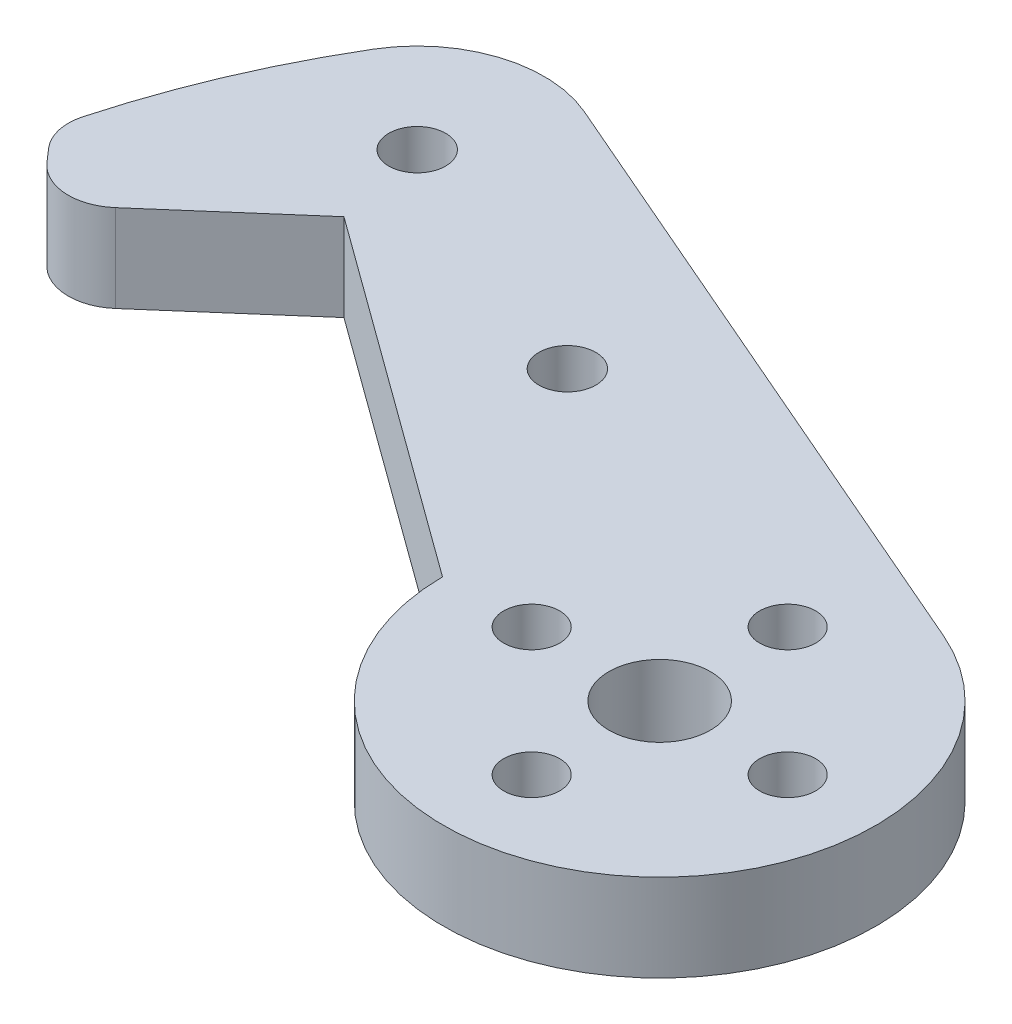
ISO-10303-21;
HEADER;
FILE_DESCRIPTION(('STEP AP214'),'2;1');
FILE_NAME('part.step','',(''),(''),'','','');
FILE_SCHEMA(('AUTOMOTIVE_DESIGN { 1 0 10303 214 1 1 1 1 }'));
ENDSEC;
DATA;
#1=APPLICATION_CONTEXT('core data for automotive mechanical design processes');
#2=APPLICATION_PROTOCOL_DEFINITION('international standard','automotive_design',2000,#1);
#3=PRODUCT_CONTEXT('',#1,'mechanical');
#4=PRODUCT('Part','Part','',(#3));
#5=PRODUCT_RELATED_PRODUCT_CATEGORY('part','',(#4));
#6=PRODUCT_DEFINITION_FORMATION('','',#4);
#7=PRODUCT_DEFINITION_CONTEXT('part definition',#1,'design');
#8=PRODUCT_DEFINITION('design','',#6,#7);
#9=PRODUCT_DEFINITION_SHAPE('','',#8);
#10=(LENGTH_UNIT() NAMED_UNIT(*) SI_UNIT(.MILLI.,.METRE.));
#11=(NAMED_UNIT(*) PLANE_ANGLE_UNIT() SI_UNIT($,.RADIAN.));
#12=(NAMED_UNIT(*) SI_UNIT($,.STERADIAN.) SOLID_ANGLE_UNIT());
#13=UNCERTAINTY_MEASURE_WITH_UNIT(LENGTH_MEASURE(1.E-05),#10,'distance_accuracy_value','');
#14=(GEOMETRIC_REPRESENTATION_CONTEXT(3) GLOBAL_UNCERTAINTY_ASSIGNED_CONTEXT((#13)) GLOBAL_UNIT_ASSIGNED_CONTEXT((#10,
#11,#12)) REPRESENTATION_CONTEXT('',''));
#15=CARTESIAN_POINT('',(0.,0.,0.));
#16=DIRECTION('',(0.,0.,1.));
#17=DIRECTION('',(1.,0.,0.));
#18=AXIS2_PLACEMENT_3D('',#15,#16,#17);
#19=CARTESIAN_POINT('',(-45.8483581971997,5.461,-12.1373981635231));
#20=DIRECTION('',(0.,-1.,0.));
#21=DIRECTION('',(0.,0.,-1.));
#22=AXIS2_PLACEMENT_3D('',#19,#20,#21);
#23=PLANE('',#22);
#24=CARTESIAN_POINT('',(-45.8483581971997,5.461,-12.1373981635231));
#25=DIRECTION('',(0.,1.,0.));
#26=DIRECTION('',(0.,0.,-1.));
#27=AXIS2_PLACEMENT_3D('',#24,#25,#26);
#28=CIRCLE('',#27,3.25);
#29=CARTESIAN_POINT('',(-48.2986608733251,5.461,-10.0023298284639));
#30=VERTEX_POINT('',#29);
#31=CARTESIAN_POINT('',(-43.7132898621404,5.461,-9.68709548739777));
#32=VERTEX_POINT('',#31);
#33=EDGE_CURVE('E157',#30,#32,#28,.T.);
#34=ORIENTED_EDGE('',*,*,#33,.T.);
#35=DIRECTION('',(0.753939284961654,0.,-0.656944103095164));
#36=VECTOR('',#35,1.);
#37=CARTESIAN_POINT('',(-36.0755531118412,5.461,-16.3422283597451));
#38=LINE('',#37,#36);
#39=CARTESIAN_POINT('',(-36.0755531118412,5.461,-16.3422283597451));
#40=VERTEX_POINT('',#39);
#41=EDGE_CURVE('E100',#32,#40,#38,.T.);
#42=ORIENTED_EDGE('',*,*,#41,.T.);
#43=DIRECTION('',(0.808767465357848,0.,0.588128546304839));
#44=VECTOR('',#43,1.);
#45=CARTESIAN_POINT('',(-36.0755531118412,5.461,-16.3422283597451));
#46=LINE('',#45,#44);
#47=CARTESIAN_POINT('',(-13.4997935259034,5.461,0.0746643018933128));
#48=VERTEX_POINT('',#47);
#49=EDGE_CURVE('E175',#40,#48,#46,.T.);
#50=ORIENTED_EDGE('',*,*,#49,.T.);
#51=CARTESIAN_POINT('',(0.,5.461,0.));
#52=DIRECTION('',(0.,1.,0.));
#53=DIRECTION('',(0.,0.,1.));
#54=AXIS2_PLACEMENT_3D('',#51,#52,#53);
#55=CIRCLE('',#54,13.5);
#56=CARTESIAN_POINT('',(5.36363887672502,5.461,-12.3887601478148));
#57=VERTEX_POINT('',#56);
#58=EDGE_CURVE('E192',#48,#57,#55,.T.);
#59=ORIENTED_EDGE('',*,*,#58,.T.);
#60=DIRECTION('',(-0.91768593687517,0.,-0.397306583461113));
#61=VECTOR('',#60,1.);
#62=CARTESIAN_POINT('',(-34.2596328863461,5.461,-29.5434163293646));
#63=LINE('',#62,#61);
#64=CARTESIAN_POINT('',(-34.2596328863461,5.461,-29.5434163293646));
#65=VERTEX_POINT('',#64);
#66=EDGE_CURVE('E191',#57,#65,#63,.T.);
#67=ORIENTED_EDGE('',*,*,#66,.T.);
#68=CARTESIAN_POINT('',(-37.4132538925687,5.461,-22.2592842054179));
#69=DIRECTION('',(0.,1.,0.));
#70=DIRECTION('',(0.,0.,1.));
#71=AXIS2_PLACEMENT_3D('',#68,#69,#70);
#72=CIRCLE('',#71,7.93750000000001);
#73=CARTESIAN_POINT('',(-44.234733224639,5.461,-26.3177723441387));
#74=VERTEX_POINT('',#73);
#75=EDGE_CURVE('E122',#65,#74,#72,.T.);
#76=ORIENTED_EDGE('',*,*,#75,.T.);
#77=CARTESIAN_POINT('',(0.,5.461,0.));
#78=DIRECTION('',(0.,1.,0.));
#79=DIRECTION('',(0.,0.,-1.));
#80=AXIS2_PLACEMENT_3D('',#77,#78,#79);
#81=CIRCLE('',#80,51.4717083902691);
#82=CARTESIAN_POINT('',(-49.6461942024214,5.461,-13.5864699546406));
#83=VERTEX_POINT('',#82);
#84=EDGE_CURVE('E116',#74,#83,#81,.T.);
#85=ORIENTED_EDGE('',*,*,#84,.T.);
#86=CARTESIAN_POINT('',(-46.7525932852344,5.461,-12.7945900824033));
#87=DIRECTION('',(0.,1.,0.));
#88=DIRECTION('',(0.,0.,1.));
#89=AXIS2_PLACEMENT_3D('',#86,#87,#88);
#90=CIRCLE('',#89,3.);
#91=CARTESIAN_POINT('',(-49.0144111401194,5.461,-10.8237577731178));
#92=VERTEX_POINT('',#91);
#93=EDGE_CURVE('E120',#83,#92,#90,.T.);
#94=ORIENTED_EDGE('',*,*,#93,.T.);
#95=DIRECTION('',(0.656944103095165,0.,0.753939284961653));
#96=VECTOR('',#95,1.);
#97=CARTESIAN_POINT('',(-48.2986608733251,5.461,-10.0023298284639));
#98=LINE('',#97,#96);
#99=EDGE_CURVE('E54',#92,#30,#98,.T.);
#100=ORIENTED_EDGE('',*,*,#99,.T.);
#101=EDGE_LOOP('',(#34,#42,#50,#59,#67,#76,#85,#94,#100));
#102=FACE_BOUND('',#101,.T.);
#103=CARTESIAN_POINT('',(-20.8624589223986,5.461,-15.0937174914343));
#104=DIRECTION('',(0.,1.,0.));
#105=DIRECTION('',(0.,0.,1.));
#106=AXIS2_PLACEMENT_3D('',#103,#104,#105);
#107=CIRCLE('',#106,1.778);
#108=CARTESIAN_POINT('',(-20.8624589223986,5.461,-13.3157174914343));
#109=VERTEX_POINT('',#108);
#110=EDGE_CURVE('E144',#109,#109,#107,.T.);
#111=ORIENTED_EDGE('',*,*,#110,.F.);
#112=EDGE_LOOP('',(#111));
#113=FACE_BOUND('',#112,.T.);
#114=CARTESIAN_POINT('',(8.00000000000001,5.461,0.));
#115=DIRECTION('',(0.,1.,0.));
#116=DIRECTION('',(0.,0.,1.));
#117=AXIS2_PLACEMENT_3D('',#114,#115,#116);
#118=CIRCLE('',#117,1.74999999999999);
#119=CARTESIAN_POINT('',(8.00000000000001,5.461,1.74999999999999));
#120=VERTEX_POINT('',#119);
#121=EDGE_CURVE('E202',#120,#120,#118,.T.);
#122=ORIENTED_EDGE('',*,*,#121,.F.);
#123=EDGE_LOOP('',(#122));
#124=FACE_BOUND('',#123,.T.);
#125=CARTESIAN_POINT('',(0.,5.461,7.99999999999999));
#126=DIRECTION('',(0.,1.,0.));
#127=DIRECTION('',(0.,0.,1.));
#128=AXIS2_PLACEMENT_3D('',#125,#126,#127);
#129=CIRCLE('',#128,1.75);
#130=CARTESIAN_POINT('',(0.,5.461,9.74999999999999));
#131=VERTEX_POINT('',#130);
#132=EDGE_CURVE('E208',#131,#131,#129,.T.);
#133=ORIENTED_EDGE('',*,*,#132,.F.);
#134=EDGE_LOOP('',(#133));
#135=FACE_BOUND('',#134,.T.);
#136=CARTESIAN_POINT('',(-8.00000000000001,5.461,0.));
#137=DIRECTION('',(0.,1.,0.));
#138=DIRECTION('',(0.,0.,1.));
#139=AXIS2_PLACEMENT_3D('',#136,#137,#138);
#140=CIRCLE('',#139,1.75000000000001);
#141=CARTESIAN_POINT('',(-8.00000000000001,5.461,1.75000000000001));
#142=VERTEX_POINT('',#141);
#143=EDGE_CURVE('E214',#142,#142,#140,.T.);
#144=ORIENTED_EDGE('',*,*,#143,.F.);
#145=EDGE_LOOP('',(#144));
#146=FACE_BOUND('',#145,.T.);
#147=CARTESIAN_POINT('',(0.,5.461,-7.99999999999999));
#148=DIRECTION('',(0.,1.,0.));
#149=DIRECTION('',(0.,0.,1.));
#150=AXIS2_PLACEMENT_3D('',#147,#148,#149);
#151=CIRCLE('',#150,1.75);
#152=CARTESIAN_POINT('',(0.,5.461,-6.24999999999999));
#153=VERTEX_POINT('',#152);
#154=EDGE_CURVE('E220',#153,#153,#151,.T.);
#155=ORIENTED_EDGE('',*,*,#154,.F.);
#156=EDGE_LOOP('',(#155));
#157=FACE_BOUND('',#156,.T.);
#158=CARTESIAN_POINT('',(0.,5.461,0.));
#159=DIRECTION('',(0.,1.,0.));
#160=DIRECTION('',(0.,0.,1.));
#161=AXIS2_PLACEMENT_3D('',#158,#159,#160);
#162=CIRCLE('',#161,3.175);
#163=CARTESIAN_POINT('',(0.,5.461,3.175));
#164=VERTEX_POINT('',#163);
#165=EDGE_CURVE('E226',#164,#164,#162,.T.);
#166=ORIENTED_EDGE('',*,*,#165,.F.);
#167=EDGE_LOOP('',(#166));
#168=FACE_BOUND('',#167,.T.);
#169=CARTESIAN_POINT('',(-37.4132538925687,5.461,-22.2592842054179));
#170=DIRECTION('',(0.,1.,0.));
#171=DIRECTION('',(0.,0.,1.));
#172=AXIS2_PLACEMENT_3D('',#169,#170,#171);
#173=CIRCLE('',#172,1.778);
#174=CARTESIAN_POINT('',(-37.4132538925687,5.461,-20.4812842054179));
#175=VERTEX_POINT('',#174);
#176=EDGE_CURVE('E232',#175,#175,#173,.T.);
#177=ORIENTED_EDGE('',*,*,#176,.F.);
#178=EDGE_LOOP('',(#177));
#179=FACE_BOUND('',#178,.T.);
#180=ADVANCED_FACE('F37',(#102,#113,#124,#135,#146,#157,#168,#179),#23,.F.);
#181=CARTESIAN_POINT('',(-45.8483581971997,0.,-12.1373981635231));
#182=DIRECTION('',(0.,-1.,0.));
#183=DIRECTION('',(0.,0.,-1.));
#184=AXIS2_PLACEMENT_3D('',#181,#182,#183);
#185=PLANE('',#184);
#186=CARTESIAN_POINT('',(0.,0.,0.));
#187=DIRECTION('',(0.,1.,0.));
#188=DIRECTION('',(0.,0.,1.));
#189=AXIS2_PLACEMENT_3D('',#186,#187,#188);
#190=CIRCLE('',#189,3.175);
#191=CARTESIAN_POINT('',(0.,0.,3.175));
#192=VERTEX_POINT('',#191);
#193=EDGE_CURVE('E229',#192,#192,#190,.T.);
#194=ORIENTED_EDGE('',*,*,#193,.T.);
#195=EDGE_LOOP('',(#194));
#196=FACE_BOUND('',#195,.T.);
#197=CARTESIAN_POINT('',(-8.00000000000001,0.,0.));
#198=DIRECTION('',(0.,1.,0.));
#199=DIRECTION('',(0.,0.,1.));
#200=AXIS2_PLACEMENT_3D('',#197,#198,#199);
#201=CIRCLE('',#200,1.75000000000001);
#202=CARTESIAN_POINT('',(-8.00000000000001,0.,1.75000000000001));
#203=VERTEX_POINT('',#202);
#204=EDGE_CURVE('E217',#203,#203,#201,.T.);
#205=ORIENTED_EDGE('',*,*,#204,.T.);
#206=EDGE_LOOP('',(#205));
#207=FACE_BOUND('',#206,.T.);
#208=CARTESIAN_POINT('',(8.00000000000001,0.,0.));
#209=DIRECTION('',(0.,1.,0.));
#210=DIRECTION('',(0.,0.,1.));
#211=AXIS2_PLACEMENT_3D('',#208,#209,#210);
#212=CIRCLE('',#211,1.74999999999999);
#213=CARTESIAN_POINT('',(8.00000000000001,0.,1.74999999999999));
#214=VERTEX_POINT('',#213);
#215=EDGE_CURVE('E205',#214,#214,#212,.T.);
#216=ORIENTED_EDGE('',*,*,#215,.T.);
#217=EDGE_LOOP('',(#216));
#218=FACE_BOUND('',#217,.T.);
#219=CARTESIAN_POINT('',(-45.8483581971997,0.,-12.1373981635231));
#220=DIRECTION('',(0.,1.,0.));
#221=DIRECTION('',(0.,0.,-1.));
#222=AXIS2_PLACEMENT_3D('',#219,#220,#221);
#223=CIRCLE('',#222,3.25);
#224=CARTESIAN_POINT('',(-48.2986608733251,0.,-10.0023298284639));
#225=VERTEX_POINT('',#224);
#226=CARTESIAN_POINT('',(-43.7132898621404,0.,-9.68709548739777));
#227=VERTEX_POINT('',#226);
#228=EDGE_CURVE('E140',#225,#227,#223,.T.);
#229=ORIENTED_EDGE('',*,*,#228,.F.);
#230=DIRECTION('',(0.656944103095165,0.,0.753939284961653));
#231=VECTOR('',#230,1.);
#232=CARTESIAN_POINT('',(-48.2986608733251,0.,-10.0023298284639));
#233=LINE('',#232,#231);
#234=CARTESIAN_POINT('',(-49.0144111401194,0.,-10.8237577731178));
#235=VERTEX_POINT('',#234);
#236=EDGE_CURVE('E92',#235,#225,#233,.T.);
#237=ORIENTED_EDGE('',*,*,#236,.F.);
#238=CARTESIAN_POINT('',(-46.7525932852344,0.,-12.7945900824033));
#239=DIRECTION('',(0.,1.,0.));
#240=DIRECTION('',(0.,0.,1.));
#241=AXIS2_PLACEMENT_3D('',#238,#239,#240);
#242=CIRCLE('',#241,3.);
#243=CARTESIAN_POINT('',(-49.6461942024214,0.,-13.5864699546406));
#244=VERTEX_POINT('',#243);
#245=EDGE_CURVE('E86',#244,#235,#242,.T.);
#246=ORIENTED_EDGE('',*,*,#245,.F.);
#247=CARTESIAN_POINT('',(0.,0.,0.));
#248=DIRECTION('',(0.,1.,0.));
#249=DIRECTION('',(0.,0.,-1.));
#250=AXIS2_PLACEMENT_3D('',#247,#248,#249);
#251=CIRCLE('',#250,51.4717083902691);
#252=CARTESIAN_POINT('',(-44.234733224639,0.,-26.3177723441387));
#253=VERTEX_POINT('',#252);
#254=EDGE_CURVE('E130',#253,#244,#251,.T.);
#255=ORIENTED_EDGE('',*,*,#254,.F.);
#256=CARTESIAN_POINT('',(-37.4132538925687,0.,-22.2592842054179));
#257=DIRECTION('',(0.,1.,0.));
#258=DIRECTION('',(0.,0.,1.));
#259=AXIS2_PLACEMENT_3D('',#256,#257,#258);
#260=CIRCLE('',#259,7.93750000000001);
#261=CARTESIAN_POINT('',(-34.2596328863461,0.,-29.5434163293646));
#262=VERTEX_POINT('',#261);
#263=EDGE_CURVE('E152',#262,#253,#260,.T.);
#264=ORIENTED_EDGE('',*,*,#263,.F.);
#265=DIRECTION('',(-0.91768593687517,0.,-0.397306583461113));
#266=VECTOR('',#265,1.);
#267=CARTESIAN_POINT('',(-34.2596328863461,0.,-29.5434163293646));
#268=LINE('',#267,#266);
#269=CARTESIAN_POINT('',(5.36363887672502,0.,-12.3887601478148));
#270=VERTEX_POINT('',#269);
#271=EDGE_CURVE('E150',#270,#262,#268,.T.);
#272=ORIENTED_EDGE('',*,*,#271,.F.);
#273=CARTESIAN_POINT('',(0.,0.,0.));
#274=DIRECTION('',(0.,1.,0.));
#275=DIRECTION('',(0.,0.,1.));
#276=AXIS2_PLACEMENT_3D('',#273,#274,#275);
#277=CIRCLE('',#276,13.5);
#278=CARTESIAN_POINT('',(-13.4997935259034,0.,0.0746643018933128));
#279=VERTEX_POINT('',#278);
#280=EDGE_CURVE('E148',#279,#270,#277,.T.);
#281=ORIENTED_EDGE('',*,*,#280,.F.);
#282=DIRECTION('',(0.808767465357848,0.,0.588128546304839));
#283=VECTOR('',#282,1.);
#284=CARTESIAN_POINT('',(-36.0755531118412,0.,-16.3422283597451));
#285=LINE('',#284,#283);
#286=CARTESIAN_POINT('',(-36.0755531118412,0.,-16.3422283597451));
#287=VERTEX_POINT('',#286);
#288=EDGE_CURVE('E146',#287,#279,#285,.T.);
#289=ORIENTED_EDGE('',*,*,#288,.F.);
#290=DIRECTION('',(0.753939284961654,0.,-0.656944103095164));
#291=VECTOR('',#290,1.);
#292=CARTESIAN_POINT('',(-36.0755531118412,0.,-16.3422283597451));
#293=LINE('',#292,#291);
#294=EDGE_CURVE('E143',#227,#287,#293,.T.);
#295=ORIENTED_EDGE('',*,*,#294,.F.);
#296=EDGE_LOOP('',(#229,#237,#246,#255,#264,#272,#281,#289,#295));
#297=FACE_BOUND('',#296,.T.);
#298=CARTESIAN_POINT('',(-20.8624589223986,0.,-15.0937174914343));
#299=DIRECTION('',(0.,1.,0.));
#300=DIRECTION('',(0.,0.,1.));
#301=AXIS2_PLACEMENT_3D('',#298,#299,#300);
#302=CIRCLE('',#301,1.778);
#303=CARTESIAN_POINT('',(-20.8624589223986,0.,-13.3157174914343));
#304=VERTEX_POINT('',#303);
#305=EDGE_CURVE('E199',#304,#304,#302,.T.);
#306=ORIENTED_EDGE('',*,*,#305,.T.);
#307=EDGE_LOOP('',(#306));
#308=FACE_BOUND('',#307,.T.);
#309=CARTESIAN_POINT('',(0.,0.,7.99999999999999));
#310=DIRECTION('',(0.,1.,0.));
#311=DIRECTION('',(0.,0.,1.));
#312=AXIS2_PLACEMENT_3D('',#309,#310,#311);
#313=CIRCLE('',#312,1.75);
#314=CARTESIAN_POINT('',(0.,0.,9.74999999999999));
#315=VERTEX_POINT('',#314);
#316=EDGE_CURVE('E211',#315,#315,#313,.T.);
#317=ORIENTED_EDGE('',*,*,#316,.T.);
#318=EDGE_LOOP('',(#317));
#319=FACE_BOUND('',#318,.T.);
#320=CARTESIAN_POINT('',(0.,0.,-7.99999999999999));
#321=DIRECTION('',(0.,1.,0.));
#322=DIRECTION('',(0.,0.,1.));
#323=AXIS2_PLACEMENT_3D('',#320,#321,#322);
#324=CIRCLE('',#323,1.75);
#325=CARTESIAN_POINT('',(0.,0.,-6.24999999999999));
#326=VERTEX_POINT('',#325);
#327=EDGE_CURVE('E223',#326,#326,#324,.T.);
#328=ORIENTED_EDGE('',*,*,#327,.T.);
#329=EDGE_LOOP('',(#328));
#330=FACE_BOUND('',#329,.T.);
#331=CARTESIAN_POINT('',(-37.4132538925687,0.,-22.2592842054179));
#332=DIRECTION('',(0.,1.,0.));
#333=DIRECTION('',(0.,0.,1.));
#334=AXIS2_PLACEMENT_3D('',#331,#332,#333);
#335=CIRCLE('',#334,1.778);
#336=CARTESIAN_POINT('',(-37.4132538925687,0.,-20.4812842054179));
#337=VERTEX_POINT('',#336);
#338=EDGE_CURVE('E235',#337,#337,#335,.T.);
#339=ORIENTED_EDGE('',*,*,#338,.T.);
#340=EDGE_LOOP('',(#339));
#341=FACE_BOUND('',#340,.T.);
#342=ADVANCED_FACE('F179',(#196,#207,#218,#297,#308,#319,#330,#341),#185,.T.);
#343=CARTESIAN_POINT('',(-45.8483581971997,5.461,-12.1373981635231));
#344=DIRECTION('',(0.,-1.,0.));
#345=DIRECTION('',(0.,0.,-1.));
#346=AXIS2_PLACEMENT_3D('',#343,#344,#345);
#347=CYLINDRICAL_SURFACE('',#346,3.25);
#348=ORIENTED_EDGE('',*,*,#228,.T.);
#349=DIRECTION('',(0.,-1.,0.));
#350=VECTOR('',#349,1.);
#351=CARTESIAN_POINT('',(-43.7132898621404,5.461,-9.68709548739777));
#352=LINE('',#351,#350);
#353=EDGE_CURVE('E11',#32,#227,#352,.T.);
#354=ORIENTED_EDGE('',*,*,#353,.F.);
#355=ORIENTED_EDGE('',*,*,#33,.F.);
#356=DIRECTION('',(0.,-1.,0.));
#357=VECTOR('',#356,1.);
#358=CARTESIAN_POINT('',(-48.2986608733251,5.461,-10.0023298284639));
#359=LINE('',#358,#357);
#360=EDGE_CURVE('E136',#30,#225,#359,.T.);
#361=ORIENTED_EDGE('',*,*,#360,.T.);
#362=EDGE_LOOP('',(#348,#354,#355,#361));
#363=FACE_BOUND('',#362,.T.);
#364=ADVANCED_FACE('F39',(#363),#347,.T.);
#365=CARTESIAN_POINT('',(-36.0755531118412,5.461,-16.3422283597451));
#366=DIRECTION('',(-0.656944103095164,0.,-0.753939284961654));
#367=DIRECTION('',(-0.753939284961654,0.,0.656944103095164));
#368=AXIS2_PLACEMENT_3D('',#365,#366,#367);
#369=PLANE('',#368);
#370=ORIENTED_EDGE('',*,*,#294,.T.);
#371=DIRECTION('',(0.,-1.,0.));
#372=VECTOR('',#371,1.);
#373=CARTESIAN_POINT('',(-36.0755531118412,5.461,-16.3422283597451));
#374=LINE('',#373,#372);
#375=EDGE_CURVE('E46',#40,#287,#374,.T.);
#376=ORIENTED_EDGE('',*,*,#375,.F.);
#377=ORIENTED_EDGE('',*,*,#41,.F.);
#378=ORIENTED_EDGE('',*,*,#353,.T.);
#379=EDGE_LOOP('',(#370,#376,#377,#378));
#380=FACE_BOUND('',#379,.T.);
#381=ADVANCED_FACE('F271',(#380),#369,.F.);
#382=CARTESIAN_POINT('',(-36.0755531118412,5.461,-16.3422283597451));
#383=DIRECTION('',(0.588128546304839,0.,-0.808767465357848));
#384=DIRECTION('',(-0.808767465357848,0.,-0.588128546304839));
#385=AXIS2_PLACEMENT_3D('',#382,#383,#384);
#386=PLANE('',#385);
#387=ORIENTED_EDGE('',*,*,#288,.T.);
#388=DIRECTION('',(0.,-1.,0.));
#389=VECTOR('',#388,1.);
#390=CARTESIAN_POINT('',(-13.4997935259034,5.461,0.0746643018933128));
#391=LINE('',#390,#389);
#392=EDGE_CURVE('E167',#48,#279,#391,.T.);
#393=ORIENTED_EDGE('',*,*,#392,.F.);
#394=ORIENTED_EDGE('',*,*,#49,.F.);
#395=ORIENTED_EDGE('',*,*,#375,.T.);
#396=EDGE_LOOP('',(#387,#393,#394,#395));
#397=FACE_BOUND('',#396,.T.);
#398=ADVANCED_FACE('F173',(#397),#386,.F.);
#399=CARTESIAN_POINT('',(0.,5.461,0.));
#400=DIRECTION('',(0.,-1.,0.));
#401=DIRECTION('',(0.,0.,-1.));
#402=AXIS2_PLACEMENT_3D('',#399,#400,#401);
#403=CYLINDRICAL_SURFACE('',#402,13.5);
#404=ORIENTED_EDGE('',*,*,#280,.T.);
#405=DIRECTION('',(0.,-1.,0.));
#406=VECTOR('',#405,1.);
#407=CARTESIAN_POINT('',(5.36363887672502,5.461,-12.3887601478148));
#408=LINE('',#407,#406);
#409=EDGE_CURVE('E164',#57,#270,#408,.T.);
#410=ORIENTED_EDGE('',*,*,#409,.F.);
#411=ORIENTED_EDGE('',*,*,#58,.F.);
#412=ORIENTED_EDGE('',*,*,#392,.T.);
#413=EDGE_LOOP('',(#404,#410,#411,#412));
#414=FACE_BOUND('',#413,.T.);
#415=ADVANCED_FACE('F185',(#414),#403,.T.);
#416=CARTESIAN_POINT('',(-34.2596328863461,5.461,-29.5434163293646));
#417=DIRECTION('',(-0.397306583461113,0.,0.917685936875169));
#418=DIRECTION('',(0.91768593687517,0.,0.397306583461113));
#419=AXIS2_PLACEMENT_3D('',#416,#417,#418);
#420=PLANE('',#419);
#421=ORIENTED_EDGE('',*,*,#271,.T.);
#422=DIRECTION('',(0.,-1.,0.));
#423=VECTOR('',#422,1.);
#424=CARTESIAN_POINT('',(-34.2596328863461,5.461,-29.5434163293646));
#425=LINE('',#424,#423);
#426=EDGE_CURVE('E161',#65,#262,#425,.T.);
#427=ORIENTED_EDGE('',*,*,#426,.F.);
#428=ORIENTED_EDGE('',*,*,#66,.F.);
#429=ORIENTED_EDGE('',*,*,#409,.T.);
#430=EDGE_LOOP('',(#421,#427,#428,#429));
#431=FACE_BOUND('',#430,.T.);
#432=ADVANCED_FACE('F189',(#431),#420,.F.);
#433=CARTESIAN_POINT('',(-37.4132538925687,5.461,-22.2592842054179));
#434=DIRECTION('',(0.,-1.,0.));
#435=DIRECTION('',(0.,0.,-1.));
#436=AXIS2_PLACEMENT_3D('',#433,#434,#435);
#437=CYLINDRICAL_SURFACE('',#436,7.93750000000001);
#438=ORIENTED_EDGE('',*,*,#263,.T.);
#439=DIRECTION('',(0.,-1.,0.));
#440=VECTOR('',#439,1.);
#441=CARTESIAN_POINT('',(-44.234733224639,5.461,-26.3177723441387));
#442=LINE('',#441,#440);
#443=EDGE_CURVE('E131',#74,#253,#442,.T.);
#444=ORIENTED_EDGE('',*,*,#443,.F.);
#445=ORIENTED_EDGE('',*,*,#75,.F.);
#446=ORIENTED_EDGE('',*,*,#426,.T.);
#447=EDGE_LOOP('',(#438,#444,#445,#446));
#448=FACE_BOUND('',#447,.T.);
#449=ADVANCED_FACE('F262',(#448),#437,.T.);
#450=CARTESIAN_POINT('',(0.,5.461,0.));
#451=DIRECTION('',(0.,-1.,0.));
#452=DIRECTION('',(0.,0.,-1.));
#453=AXIS2_PLACEMENT_3D('',#450,#451,#452);
#454=CYLINDRICAL_SURFACE('',#453,51.4717083902691);
#455=ORIENTED_EDGE('',*,*,#254,.T.);
#456=DIRECTION('',(0.,-1.,0.));
#457=VECTOR('',#456,1.);
#458=CARTESIAN_POINT('',(-49.6461942024214,5.461,-13.5864699546406));
#459=LINE('',#458,#457);
#460=EDGE_CURVE('E127',#83,#244,#459,.T.);
#461=ORIENTED_EDGE('',*,*,#460,.F.);
#462=ORIENTED_EDGE('',*,*,#84,.F.);
#463=ORIENTED_EDGE('',*,*,#443,.T.);
#464=EDGE_LOOP('',(#455,#461,#462,#463));
#465=FACE_BOUND('',#464,.T.);
#466=ADVANCED_FACE('F128',(#465),#454,.T.);
#467=CARTESIAN_POINT('',(-46.7525932852344,5.461,-12.7945900824033));
#468=DIRECTION('',(0.,-1.,0.));
#469=DIRECTION('',(0.,0.,-1.));
#470=AXIS2_PLACEMENT_3D('',#467,#468,#469);
#471=CYLINDRICAL_SURFACE('',#470,3.);
#472=ORIENTED_EDGE('',*,*,#245,.T.);
#473=DIRECTION('',(0.,-1.,0.));
#474=VECTOR('',#473,1.);
#475=CARTESIAN_POINT('',(-49.0144111401194,5.461,-10.8237577731178));
#476=LINE('',#475,#474);
#477=EDGE_CURVE('E132',#92,#235,#476,.T.);
#478=ORIENTED_EDGE('',*,*,#477,.F.);
#479=ORIENTED_EDGE('',*,*,#93,.F.);
#480=ORIENTED_EDGE('',*,*,#460,.T.);
#481=EDGE_LOOP('',(#472,#478,#479,#480));
#482=FACE_BOUND('',#481,.T.);
#483=ADVANCED_FACE('F134',(#482),#471,.T.);
#484=CARTESIAN_POINT('',(-48.2986608733251,5.461,-10.0023298284639));
#485=DIRECTION('',(0.753939284961653,0.,-0.656944103095166));
#486=DIRECTION('',(-0.656944103095166,0.,-0.753939284961653));
#487=AXIS2_PLACEMENT_3D('',#484,#485,#486);
#488=PLANE('',#487);
#489=ORIENTED_EDGE('',*,*,#236,.T.);
#490=ORIENTED_EDGE('',*,*,#360,.F.);
#491=ORIENTED_EDGE('',*,*,#99,.F.);
#492=ORIENTED_EDGE('',*,*,#477,.T.);
#493=EDGE_LOOP('',(#489,#490,#491,#492));
#494=FACE_BOUND('',#493,.T.);
#495=ADVANCED_FACE('F255',(#494),#488,.F.);
#496=CARTESIAN_POINT('',(-20.8624589223986,5.461,-15.0937174914343));
#497=DIRECTION('',(0.,-1.,0.));
#498=DIRECTION('',(0.,0.,-1.));
#499=AXIS2_PLACEMENT_3D('',#496,#497,#498);
#500=CYLINDRICAL_SURFACE('',#499,1.778);
#501=ORIENTED_EDGE('',*,*,#110,.T.);
#502=EDGE_LOOP('',(#501));
#503=FACE_BOUND('',#502,.T.);
#504=ORIENTED_EDGE('',*,*,#305,.F.);
#505=EDGE_LOOP('',(#504));
#506=FACE_BOUND('',#505,.T.);
#507=ADVANCED_FACE('F252',(#503,#506),#500,.F.);
#508=CARTESIAN_POINT('',(8.00000000000001,5.461,0.));
#509=DIRECTION('',(0.,-1.,0.));
#510=DIRECTION('',(0.,0.,-1.));
#511=AXIS2_PLACEMENT_3D('',#508,#509,#510);
#512=CYLINDRICAL_SURFACE('',#511,1.74999999999999);
#513=ORIENTED_EDGE('',*,*,#121,.T.);
#514=EDGE_LOOP('',(#513));
#515=FACE_BOUND('',#514,.T.);
#516=ORIENTED_EDGE('',*,*,#215,.F.);
#517=EDGE_LOOP('',(#516));
#518=FACE_BOUND('',#517,.T.);
#519=ADVANCED_FACE('F351',(#515,#518),#512,.F.);
#520=CARTESIAN_POINT('',(0.,5.461,7.99999999999999));
#521=DIRECTION('',(0.,-1.,0.));
#522=DIRECTION('',(0.,0.,-1.));
#523=AXIS2_PLACEMENT_3D('',#520,#521,#522);
#524=CYLINDRICAL_SURFACE('',#523,1.75);
#525=ORIENTED_EDGE('',*,*,#132,.T.);
#526=EDGE_LOOP('',(#525));
#527=FACE_BOUND('',#526,.T.);
#528=ORIENTED_EDGE('',*,*,#316,.F.);
#529=EDGE_LOOP('',(#528));
#530=FACE_BOUND('',#529,.T.);
#531=ADVANCED_FACE('F360',(#527,#530),#524,.F.);
#532=CARTESIAN_POINT('',(-8.00000000000001,5.461,0.));
#533=DIRECTION('',(0.,-1.,0.));
#534=DIRECTION('',(0.,0.,-1.));
#535=AXIS2_PLACEMENT_3D('',#532,#533,#534);
#536=CYLINDRICAL_SURFACE('',#535,1.75000000000001);
#537=ORIENTED_EDGE('',*,*,#143,.T.);
#538=EDGE_LOOP('',(#537));
#539=FACE_BOUND('',#538,.T.);
#540=ORIENTED_EDGE('',*,*,#204,.F.);
#541=EDGE_LOOP('',(#540));
#542=FACE_BOUND('',#541,.T.);
#543=ADVANCED_FACE('F369',(#539,#542),#536,.F.);
#544=CARTESIAN_POINT('',(0.,5.461,-7.99999999999999));
#545=DIRECTION('',(0.,-1.,0.));
#546=DIRECTION('',(0.,0.,-1.));
#547=AXIS2_PLACEMENT_3D('',#544,#545,#546);
#548=CYLINDRICAL_SURFACE('',#547,1.75);
#549=ORIENTED_EDGE('',*,*,#154,.T.);
#550=EDGE_LOOP('',(#549));
#551=FACE_BOUND('',#550,.T.);
#552=ORIENTED_EDGE('',*,*,#327,.F.);
#553=EDGE_LOOP('',(#552));
#554=FACE_BOUND('',#553,.T.);
#555=ADVANCED_FACE('F379',(#551,#554),#548,.F.);
#556=CARTESIAN_POINT('',(0.,5.461,0.));
#557=DIRECTION('',(0.,-1.,0.));
#558=DIRECTION('',(0.,0.,-1.));
#559=AXIS2_PLACEMENT_3D('',#556,#557,#558);
#560=CYLINDRICAL_SURFACE('',#559,3.175);
#561=ORIENTED_EDGE('',*,*,#165,.T.);
#562=EDGE_LOOP('',(#561));
#563=FACE_BOUND('',#562,.T.);
#564=ORIENTED_EDGE('',*,*,#193,.F.);
#565=EDGE_LOOP('',(#564));
#566=FACE_BOUND('',#565,.T.);
#567=ADVANCED_FACE('F389',(#563,#566),#560,.F.);
#568=CARTESIAN_POINT('',(-37.4132538925687,5.461,-22.2592842054179));
#569=DIRECTION('',(0.,-1.,0.));
#570=DIRECTION('',(0.,0.,-1.));
#571=AXIS2_PLACEMENT_3D('',#568,#569,#570);
#572=CYLINDRICAL_SURFACE('',#571,1.778);
#573=ORIENTED_EDGE('',*,*,#176,.T.);
#574=EDGE_LOOP('',(#573));
#575=FACE_BOUND('',#574,.T.);
#576=ORIENTED_EDGE('',*,*,#338,.F.);
#577=EDGE_LOOP('',(#576));
#578=FACE_BOUND('',#577,.T.);
#579=ADVANCED_FACE('F241',(#575,#578),#572,.F.);
#580=CLOSED_SHELL('',(#180,#342,#364,#381,#398,#415,#432,#449,#466,#483,#495,#507,#519,#531,
#543,#555,#567,#579));
#581=MANIFOLD_SOLID_BREP('B2',#580);
#582=ADVANCED_BREP_SHAPE_REPRESENTATION('',(#18,#581),#14);
#583=SHAPE_DEFINITION_REPRESENTATION(#9,#582);
ENDSEC;
END-ISO-10303-21;
